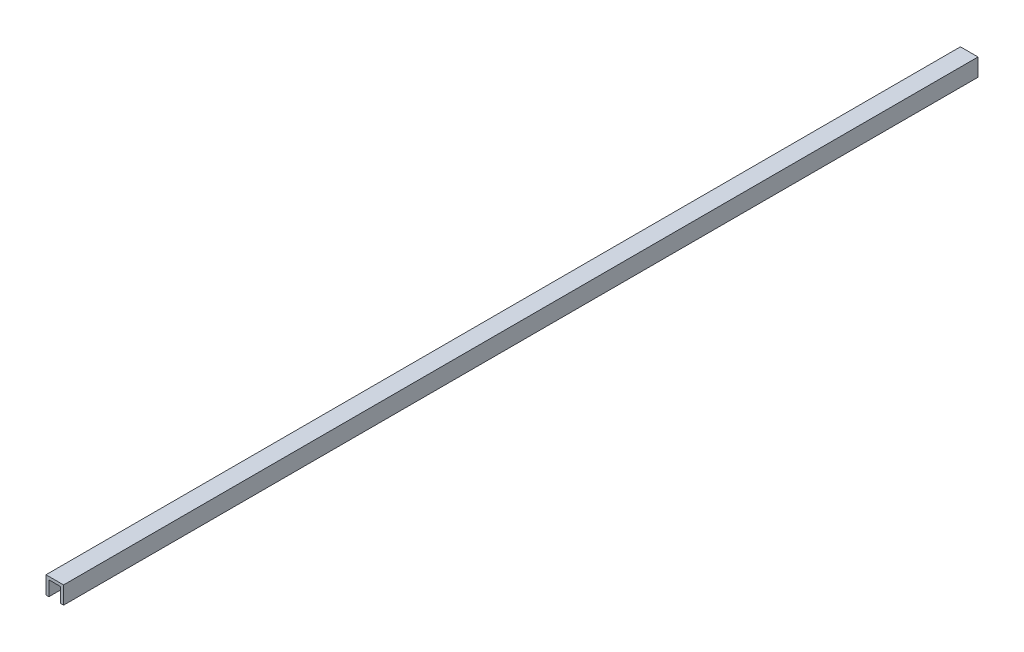
ISO-10303-21;
HEADER;
FILE_DESCRIPTION(('STEP AP214'),'2;1');
FILE_NAME('part.step','',(''),(''),'','','');
FILE_SCHEMA(('AUTOMOTIVE_DESIGN { 1 0 10303 214 1 1 1 1 }'));
ENDSEC;
DATA;
#1=APPLICATION_CONTEXT('core data for automotive mechanical design processes');
#2=APPLICATION_PROTOCOL_DEFINITION('international standard','automotive_design',2000,#1);
#3=PRODUCT_CONTEXT('',#1,'mechanical');
#4=PRODUCT('Part','Part','',(#3));
#5=PRODUCT_RELATED_PRODUCT_CATEGORY('part','',(#4));
#6=PRODUCT_DEFINITION_FORMATION('','',#4);
#7=PRODUCT_DEFINITION_CONTEXT('part definition',#1,'design');
#8=PRODUCT_DEFINITION('design','',#6,#7);
#9=PRODUCT_DEFINITION_SHAPE('','',#8);
#10=(LENGTH_UNIT() NAMED_UNIT(*) SI_UNIT(.MILLI.,.METRE.));
#11=(NAMED_UNIT(*) PLANE_ANGLE_UNIT() SI_UNIT($,.RADIAN.));
#12=(NAMED_UNIT(*) SI_UNIT($,.STERADIAN.) SOLID_ANGLE_UNIT());
#13=UNCERTAINTY_MEASURE_WITH_UNIT(LENGTH_MEASURE(1.E-05),#10,'distance_accuracy_value','');
#14=(GEOMETRIC_REPRESENTATION_CONTEXT(3) GLOBAL_UNCERTAINTY_ASSIGNED_CONTEXT((#13)) GLOBAL_UNIT_ASSIGNED_CONTEXT((#10,
#11,#12)) REPRESENTATION_CONTEXT('',''));
#15=CARTESIAN_POINT('',(0.,0.,0.));
#16=DIRECTION('',(0.,0.,1.));
#17=DIRECTION('',(1.,0.,0.));
#18=AXIS2_PLACEMENT_3D('',#15,#16,#17);
#19=CARTESIAN_POINT('',(-22.2249996013287,0.110340831200167,0.));
#20=DIRECTION('',(-1.,0.,0.));
#21=DIRECTION('',(0.,0.,1.));
#22=AXIS2_PLACEMENT_3D('',#19,#20,#21);
#23=PLANE('',#22);
#24=DIRECTION('',(0.,1.,0.));
#25=VECTOR('',#24,1.);
#26=CARTESIAN_POINT('',(-22.2249996013287,11.0360761253178,990.6));
#27=LINE('',#26,#25);
#28=CARTESIAN_POINT('',(-22.2249996013287,19.1603408312002,990.6));
#29=VERTEX_POINT('',#28);
#30=CARTESIAN_POINT('',(-22.2249996013287,0.110340831200167,990.6));
#31=VERTEX_POINT('',#30);
#32=EDGE_CURVE('E121',#29,#31,#27,.F.);
#33=ORIENTED_EDGE('',*,*,#32,.F.);
#34=DIRECTION('',(0.,0.,1.));
#35=VECTOR('',#34,1.);
#36=CARTESIAN_POINT('',(-22.2249996013287,19.1603408312002,0.));
#37=LINE('',#36,#35);
#38=CARTESIAN_POINT('',(-22.2249996013287,19.1603408312002,0.));
#39=VERTEX_POINT('',#38);
#40=EDGE_CURVE('E87',#39,#29,#37,.T.);
#41=ORIENTED_EDGE('',*,*,#40,.F.);
#42=DIRECTION('',(0.,1.,0.));
#43=VECTOR('',#42,1.);
#44=CARTESIAN_POINT('',(-22.2249996013287,11.0360761253178,0.));
#45=LINE('',#44,#43);
#46=CARTESIAN_POINT('',(-22.2249996013287,0.110340831200167,0.));
#47=VERTEX_POINT('',#46);
#48=EDGE_CURVE('E84',#39,#47,#45,.F.);
#49=ORIENTED_EDGE('',*,*,#48,.T.);
#50=DIRECTION('',(0.,0.,-1.));
#51=VECTOR('',#50,1.);
#52=CARTESIAN_POINT('',(-22.2249996013287,0.110340831200167,0.));
#53=LINE('',#52,#51);
#54=EDGE_CURVE('E20',#31,#47,#53,.T.);
#55=ORIENTED_EDGE('',*,*,#54,.F.);
#56=EDGE_LOOP('',(#33,#41,#49,#55));
#57=FACE_BOUND('',#56,.T.);
#58=ADVANCED_FACE('F17',(#57),#23,.T.);
#59=CARTESIAN_POINT('',(-19.0499996013287,0.110340831200167,0.));
#60=DIRECTION('',(0.,-1.,0.));
#61=DIRECTION('',(0.,0.,-1.));
#62=AXIS2_PLACEMENT_3D('',#59,#60,#61);
#63=PLANE('',#62);
#64=DIRECTION('',(1.,0.,0.));
#65=VECTOR('',#64,1.);
#66=CARTESIAN_POINT('',(-12.6999996013287,0.110340831200168,990.6));
#67=LINE('',#66,#65);
#68=CARTESIAN_POINT('',(-19.0499996013287,0.110340831200167,990.6));
#69=VERTEX_POINT('',#68);
#70=EDGE_CURVE('E94',#31,#69,#67,.T.);
#71=ORIENTED_EDGE('',*,*,#70,.F.);
#72=ORIENTED_EDGE('',*,*,#54,.T.);
#73=DIRECTION('',(1.,0.,0.));
#74=VECTOR('',#73,1.);
#75=CARTESIAN_POINT('',(-12.6999996013287,0.110340831200166,0.));
#76=LINE('',#75,#74);
#77=CARTESIAN_POINT('',(-19.0499996013287,0.110340831200166,0.));
#78=VERTEX_POINT('',#77);
#79=EDGE_CURVE('E79',#47,#78,#76,.T.);
#80=ORIENTED_EDGE('',*,*,#79,.T.);
#81=DIRECTION('',(0.,0.,-1.));
#82=VECTOR('',#81,1.);
#83=CARTESIAN_POINT('',(-19.0499996013287,0.110340831200165,0.));
#84=LINE('',#83,#82);
#85=EDGE_CURVE('E96',#69,#78,#84,.T.);
#86=ORIENTED_EDGE('',*,*,#85,.F.);
#87=EDGE_LOOP('',(#71,#72,#80,#86));
#88=FACE_BOUND('',#87,.T.);
#89=ADVANCED_FACE('F92',(#88),#63,.T.);
#90=CARTESIAN_POINT('',(-19.0499996013287,15.9853408312002,0.));
#91=DIRECTION('',(1.,0.,0.));
#92=DIRECTION('',(0.,0.,-1.));
#93=AXIS2_PLACEMENT_3D('',#90,#91,#92);
#94=PLANE('',#93);
#95=DIRECTION('',(0.,1.,0.));
#96=VECTOR('',#95,1.);
#97=CARTESIAN_POINT('',(-19.0499996013287,11.0360761253178,990.6));
#98=LINE('',#97,#96);
#99=CARTESIAN_POINT('',(-19.0499996013287,15.9853408312002,990.6));
#100=VERTEX_POINT('',#99);
#101=EDGE_CURVE('E114',#69,#100,#98,.T.);
#102=ORIENTED_EDGE('',*,*,#101,.F.);
#103=ORIENTED_EDGE('',*,*,#85,.T.);
#104=DIRECTION('',(0.,1.,0.));
#105=VECTOR('',#104,1.);
#106=CARTESIAN_POINT('',(-19.0499996013287,11.0360761253178,0.));
#107=LINE('',#106,#105);
#108=CARTESIAN_POINT('',(-19.0499996013287,15.9853408312002,0.));
#109=VERTEX_POINT('',#108);
#110=EDGE_CURVE('E100',#78,#109,#107,.T.);
#111=ORIENTED_EDGE('',*,*,#110,.T.);
#112=DIRECTION('',(0.,0.,-1.));
#113=VECTOR('',#112,1.);
#114=CARTESIAN_POINT('',(-19.0499996013287,15.9853408312002,0.));
#115=LINE('',#114,#113);
#116=EDGE_CURVE('E108',#100,#109,#115,.T.);
#117=ORIENTED_EDGE('',*,*,#116,.F.);
#118=EDGE_LOOP('',(#102,#103,#111,#117));
#119=FACE_BOUND('',#118,.T.);
#120=ADVANCED_FACE('F112',(#119),#94,.T.);
#121=CARTESIAN_POINT('',(-6.34999960132871,15.9853408312002,0.));
#122=DIRECTION('',(0.,-1.,0.));
#123=DIRECTION('',(0.,0.,-1.));
#124=AXIS2_PLACEMENT_3D('',#121,#122,#123);
#125=PLANE('',#124);
#126=DIRECTION('',(1.,0.,0.));
#127=VECTOR('',#126,1.);
#128=CARTESIAN_POINT('',(-12.6999996013287,15.9853408312002,990.6));
#129=LINE('',#128,#127);
#130=CARTESIAN_POINT('',(-6.34999960132871,15.9853408312002,990.6));
#131=VERTEX_POINT('',#130);
#132=EDGE_CURVE('E117',#100,#131,#129,.T.);
#133=ORIENTED_EDGE('',*,*,#132,.F.);
#134=ORIENTED_EDGE('',*,*,#116,.T.);
#135=DIRECTION('',(1.,0.,0.));
#136=VECTOR('',#135,1.);
#137=CARTESIAN_POINT('',(-12.6999996013287,15.9853408312002,0.));
#138=LINE('',#137,#136);
#139=CARTESIAN_POINT('',(-6.34999960132871,15.9853408312002,0.));
#140=VERTEX_POINT('',#139);
#141=EDGE_CURVE('E102',#109,#140,#138,.T.);
#142=ORIENTED_EDGE('',*,*,#141,.T.);
#143=DIRECTION('',(0.,0.,1.));
#144=VECTOR('',#143,1.);
#145=CARTESIAN_POINT('',(-6.34999960132871,15.9853408312002,0.));
#146=LINE('',#145,#144);
#147=EDGE_CURVE('E90',#131,#140,#146,.F.);
#148=ORIENTED_EDGE('',*,*,#147,.F.);
#149=EDGE_LOOP('',(#133,#134,#142,#148));
#150=FACE_BOUND('',#149,.T.);
#151=ADVANCED_FACE('F133',(#150),#125,.T.);
#152=CARTESIAN_POINT('',(-6.34999960132871,0.110340831200167,0.));
#153=DIRECTION('',(-1.,0.,0.));
#154=DIRECTION('',(0.,0.,1.));
#155=AXIS2_PLACEMENT_3D('',#152,#153,#154);
#156=PLANE('',#155);
#157=DIRECTION('',(0.,1.,0.));
#158=VECTOR('',#157,1.);
#159=CARTESIAN_POINT('',(-6.34999960132871,11.0360761253178,990.6));
#160=LINE('',#159,#158);
#161=CARTESIAN_POINT('',(-6.34999960132871,0.110340831200168,990.6));
#162=VERTEX_POINT('',#161);
#163=EDGE_CURVE('E140',#131,#162,#160,.F.);
#164=ORIENTED_EDGE('',*,*,#163,.F.);
#165=ORIENTED_EDGE('',*,*,#147,.T.);
#166=DIRECTION('',(0.,1.,0.));
#167=VECTOR('',#166,1.);
#168=CARTESIAN_POINT('',(-6.34999960132871,11.0360761253178,0.));
#169=LINE('',#168,#167);
#170=CARTESIAN_POINT('',(-6.34999960132871,0.110340831200168,0.));
#171=VERTEX_POINT('',#170);
#172=EDGE_CURVE('E131',#140,#171,#169,.F.);
#173=ORIENTED_EDGE('',*,*,#172,.T.);
#174=DIRECTION('',(0.,0.,-1.));
#175=VECTOR('',#174,1.);
#176=CARTESIAN_POINT('',(-6.34999960132871,0.110340831200167,0.));
#177=LINE('',#176,#175);
#178=EDGE_CURVE('E148',#162,#171,#177,.T.);
#179=ORIENTED_EDGE('',*,*,#178,.F.);
#180=EDGE_LOOP('',(#164,#165,#173,#179));
#181=FACE_BOUND('',#180,.T.);
#182=ADVANCED_FACE('F137',(#181),#156,.T.);
#183=CARTESIAN_POINT('',(-12.6999996013287,11.0360761253178,0.));
#184=DIRECTION('',(0.,0.,1.));
#185=DIRECTION('',(1.,0.,0.));
#186=AXIS2_PLACEMENT_3D('',#183,#184,#185);
#187=PLANE('',#186);
#188=DIRECTION('',(0.,1.,0.));
#189=VECTOR('',#188,1.);
#190=CARTESIAN_POINT('',(-3.17499960132871,19.1603408312002,0.));
#191=LINE('',#190,#189);
#192=CARTESIAN_POINT('',(-3.17499960132871,0.110340831200167,0.));
#193=VERTEX_POINT('',#192);
#194=CARTESIAN_POINT('',(-3.17499960132871,19.1603408312002,0.));
#195=VERTEX_POINT('',#194);
#196=EDGE_CURVE('E145',#193,#195,#191,.T.);
#197=ORIENTED_EDGE('',*,*,#196,.F.);
#198=DIRECTION('',(1.,0.,0.));
#199=VECTOR('',#198,1.);
#200=CARTESIAN_POINT('',(-3.17499960132871,0.110340831200167,0.));
#201=LINE('',#200,#199);
#202=EDGE_CURVE('E142',#171,#193,#201,.T.);
#203=ORIENTED_EDGE('',*,*,#202,.F.);
#204=ORIENTED_EDGE('',*,*,#172,.F.);
#205=ORIENTED_EDGE('',*,*,#141,.F.);
#206=ORIENTED_EDGE('',*,*,#110,.F.);
#207=ORIENTED_EDGE('',*,*,#79,.F.);
#208=ORIENTED_EDGE('',*,*,#48,.F.);
#209=DIRECTION('',(1.,0.,0.));
#210=VECTOR('',#209,1.);
#211=CARTESIAN_POINT('',(-22.2249996013287,19.1603408312002,0.));
#212=LINE('',#211,#210);
#213=EDGE_CURVE('E129',#195,#39,#212,.F.);
#214=ORIENTED_EDGE('',*,*,#213,.F.);
#215=EDGE_LOOP('',(#197,#203,#204,#205,#206,#207,#208,#214));
#216=FACE_BOUND('',#215,.T.);
#217=ADVANCED_FACE('F98',(#216),#187,.F.);
#218=CARTESIAN_POINT('',(-22.2249996013287,19.1603408312002,0.));
#219=DIRECTION('',(0.,1.,0.));
#220=DIRECTION('',(0.,0.,1.));
#221=AXIS2_PLACEMENT_3D('',#218,#219,#220);
#222=PLANE('',#221);
#223=DIRECTION('',(1.,0.,0.));
#224=VECTOR('',#223,1.);
#225=CARTESIAN_POINT('',(-12.6999996013287,19.1603408312002,990.6));
#226=LINE('',#225,#224);
#227=CARTESIAN_POINT('',(-3.17499960132871,19.1603408312002,990.6));
#228=VERTEX_POINT('',#227);
#229=EDGE_CURVE('E123',#228,#29,#226,.F.);
#230=ORIENTED_EDGE('',*,*,#229,.F.);
#231=DIRECTION('',(0.,0.,-1.));
#232=VECTOR('',#231,1.);
#233=CARTESIAN_POINT('',(-3.17499960132871,19.1603408312002,0.));
#234=LINE('',#233,#232);
#235=EDGE_CURVE('E151',#195,#228,#234,.F.);
#236=ORIENTED_EDGE('',*,*,#235,.F.);
#237=ORIENTED_EDGE('',*,*,#213,.T.);
#238=ORIENTED_EDGE('',*,*,#40,.T.);
#239=EDGE_LOOP('',(#230,#236,#237,#238));
#240=FACE_BOUND('',#239,.T.);
#241=ADVANCED_FACE('F163',(#240),#222,.T.);
#242=CARTESIAN_POINT('',(-12.6999996013287,11.0360761253178,990.6));
#243=DIRECTION('',(0.,0.,1.));
#244=DIRECTION('',(1.,0.,0.));
#245=AXIS2_PLACEMENT_3D('',#242,#243,#244);
#246=PLANE('',#245);
#247=ORIENTED_EDGE('',*,*,#132,.T.);
#248=ORIENTED_EDGE('',*,*,#163,.T.);
#249=DIRECTION('',(1.,0.,0.));
#250=VECTOR('',#249,1.);
#251=CARTESIAN_POINT('',(-3.17499960132871,0.110340831200167,990.6));
#252=LINE('',#251,#250);
#253=CARTESIAN_POINT('',(-3.17499960132871,0.110340831200167,990.6));
#254=VERTEX_POINT('',#253);
#255=EDGE_CURVE('E35',#254,#162,#252,.F.);
#256=ORIENTED_EDGE('',*,*,#255,.F.);
#257=DIRECTION('',(0.,1.,0.));
#258=VECTOR('',#257,1.);
#259=CARTESIAN_POINT('',(-3.17499960132871,19.1603408312002,990.6));
#260=LINE('',#259,#258);
#261=EDGE_CURVE('E26',#228,#254,#260,.F.);
#262=ORIENTED_EDGE('',*,*,#261,.F.);
#263=ORIENTED_EDGE('',*,*,#229,.T.);
#264=ORIENTED_EDGE('',*,*,#32,.T.);
#265=ORIENTED_EDGE('',*,*,#70,.T.);
#266=ORIENTED_EDGE('',*,*,#101,.T.);
#267=EDGE_LOOP('',(#247,#248,#256,#262,#263,#264,#265,#266));
#268=FACE_BOUND('',#267,.T.);
#269=ADVANCED_FACE('F119',(#268),#246,.T.);
#270=CARTESIAN_POINT('',(-3.17499960132871,0.110340831200167,0.));
#271=DIRECTION('',(0.,-1.,0.));
#272=DIRECTION('',(0.,0.,-1.));
#273=AXIS2_PLACEMENT_3D('',#270,#271,#272);
#274=PLANE('',#273);
#275=ORIENTED_EDGE('',*,*,#255,.T.);
#276=ORIENTED_EDGE('',*,*,#178,.T.);
#277=ORIENTED_EDGE('',*,*,#202,.T.);
#278=DIRECTION('',(0.,0.,-1.));
#279=VECTOR('',#278,1.);
#280=CARTESIAN_POINT('',(-3.17499960132871,0.110340831200165,0.));
#281=LINE('',#280,#279);
#282=EDGE_CURVE('E11',#254,#193,#281,.T.);
#283=ORIENTED_EDGE('',*,*,#282,.F.);
#284=EDGE_LOOP('',(#275,#276,#277,#283));
#285=FACE_BOUND('',#284,.T.);
#286=ADVANCED_FACE('F149',(#285),#274,.T.);
#287=CARTESIAN_POINT('',(-3.17499960132871,19.1603408312002,0.));
#288=DIRECTION('',(1.,0.,0.));
#289=DIRECTION('',(0.,0.,-1.));
#290=AXIS2_PLACEMENT_3D('',#287,#288,#289);
#291=PLANE('',#290);
#292=ORIENTED_EDGE('',*,*,#261,.T.);
#293=ORIENTED_EDGE('',*,*,#282,.T.);
#294=ORIENTED_EDGE('',*,*,#196,.T.);
#295=ORIENTED_EDGE('',*,*,#235,.T.);
#296=EDGE_LOOP('',(#292,#293,#294,#295));
#297=FACE_BOUND('',#296,.T.);
#298=ADVANCED_FACE('F160',(#297),#291,.T.);
#299=CLOSED_SHELL('',(#58,#89,#120,#151,#182,#217,#241,#269,#286,#298));
#300=MANIFOLD_SOLID_BREP('B1',#299);
#301=ADVANCED_BREP_SHAPE_REPRESENTATION('',(#18,#300),#14);
#302=SHAPE_DEFINITION_REPRESENTATION(#9,#301);
ENDSEC;
END-ISO-10303-21;
